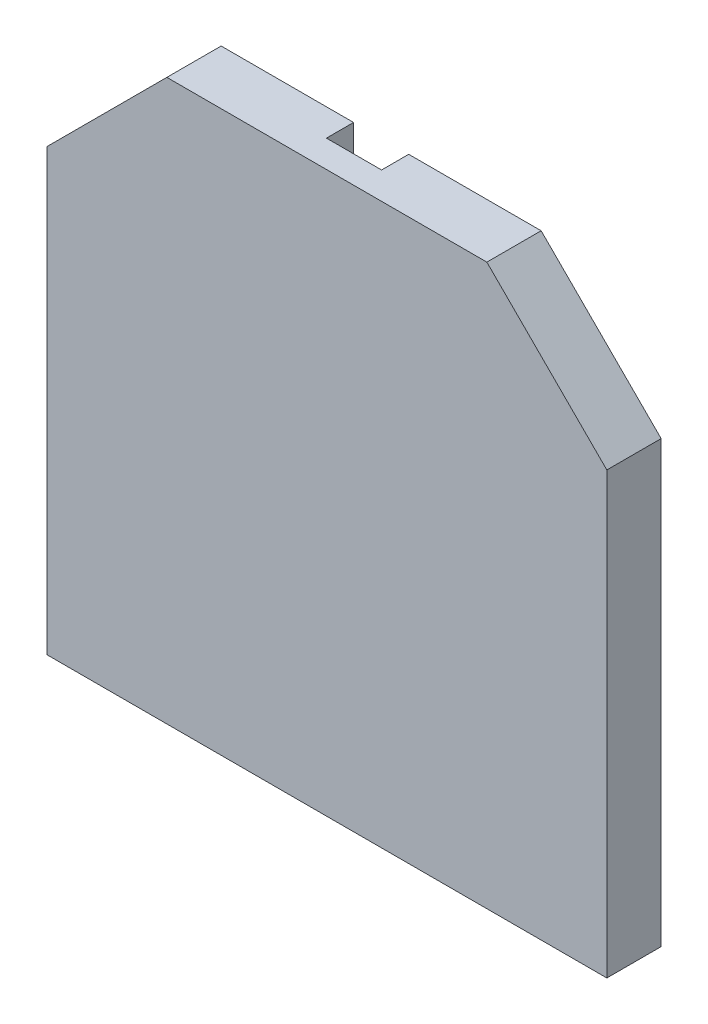
ISO-10303-21;
HEADER;
FILE_DESCRIPTION(('STEP AP214'),'2;1');
FILE_NAME('part.step','',(''),(''),'','','');
FILE_SCHEMA(('AUTOMOTIVE_DESIGN { 1 0 10303 214 1 1 1 1 }'));
ENDSEC;
DATA;
#1=APPLICATION_CONTEXT('core data for automotive mechanical design processes');
#2=APPLICATION_PROTOCOL_DEFINITION('international standard','automotive_design',2000,#1);
#3=PRODUCT_CONTEXT('',#1,'mechanical');
#4=PRODUCT('Part','Part','',(#3));
#5=PRODUCT_RELATED_PRODUCT_CATEGORY('part','',(#4));
#6=PRODUCT_DEFINITION_FORMATION('','',#4);
#7=PRODUCT_DEFINITION_CONTEXT('part definition',#1,'design');
#8=PRODUCT_DEFINITION('design','',#6,#7);
#9=PRODUCT_DEFINITION_SHAPE('','',#8);
#10=(LENGTH_UNIT() NAMED_UNIT(*) SI_UNIT(.MILLI.,.METRE.));
#11=(NAMED_UNIT(*) PLANE_ANGLE_UNIT() SI_UNIT($,.RADIAN.));
#12=(NAMED_UNIT(*) SI_UNIT($,.STERADIAN.) SOLID_ANGLE_UNIT());
#13=UNCERTAINTY_MEASURE_WITH_UNIT(LENGTH_MEASURE(1.E-05),#10,'distance_accuracy_value','');
#14=(GEOMETRIC_REPRESENTATION_CONTEXT(3) GLOBAL_UNCERTAINTY_ASSIGNED_CONTEXT((#13)) GLOBAL_UNIT_ASSIGNED_CONTEXT((#10,
#11,#12)) REPRESENTATION_CONTEXT('',''));
#15=CARTESIAN_POINT('',(0.,0.,0.));
#16=DIRECTION('',(0.,0.,1.));
#17=DIRECTION('',(1.,0.,0.));
#18=AXIS2_PLACEMENT_3D('',#15,#16,#17);
#19=CARTESIAN_POINT('',(-0.32500316,-3.71420136,0.31999936));
#20=DIRECTION('',(0.,0.,-1.));
#21=DIRECTION('',(-1.,0.,0.));
#22=AXIS2_PLACEMENT_3D('',#19,#20,#21);
#23=PLANE('',#22);
#24=DIRECTION('',(1.,0.,0.));
#25=VECTOR('',#24,1.);
#26=CARTESIAN_POINT('',(0.32499808,-3.71420136,0.31999936));
#27=LINE('',#26,#25);
#28=CARTESIAN_POINT('',(0.32499808,-3.71420136,0.31999936));
#29=VERTEX_POINT('',#28);
#30=CARTESIAN_POINT('',(-0.32500316,-3.71420136,0.31999936));
#31=VERTEX_POINT('',#30);
#32=EDGE_CURVE('E151',#29,#31,#27,.F.);
#33=ORIENTED_EDGE('',*,*,#32,.F.);
#34=DIRECTION('',(0.,1.,0.));
#35=VECTOR('',#34,1.);
#36=CARTESIAN_POINT('',(0.32499808,-6.31420124,0.31999936));
#37=LINE('',#36,#35);
#38=CARTESIAN_POINT('',(0.32499808,-6.11420164,0.31999936));
#39=VERTEX_POINT('',#38);
#40=EDGE_CURVE('E157',#39,#29,#37,.T.);
#41=ORIENTED_EDGE('',*,*,#40,.F.);
#42=DIRECTION('',(-1.,0.,0.));
#43=VECTOR('',#42,1.);
#44=CARTESIAN_POINT('',(-0.32500316,-6.11420164,0.31999936));
#45=LINE('',#44,#43);
#46=CARTESIAN_POINT('',(-0.32500316,-6.11420164,0.31999936));
#47=VERTEX_POINT('',#46);
#48=EDGE_CURVE('E19',#39,#47,#45,.T.);
#49=ORIENTED_EDGE('',*,*,#48,.T.);
#50=DIRECTION('',(0.,1.,0.));
#51=VECTOR('',#50,1.);
#52=CARTESIAN_POINT('',(-0.32500316,-3.71420136,0.31999936));
#53=LINE('',#52,#51);
#54=EDGE_CURVE('E145',#31,#47,#53,.F.);
#55=ORIENTED_EDGE('',*,*,#54,.F.);
#56=EDGE_LOOP('',(#33,#41,#49,#55));
#57=FACE_BOUND('',#56,.T.);
#58=ADVANCED_FACE('F16',(#57),#23,.T.);
#59=CARTESIAN_POINT('',(-0.32500316,0.68579492,0.31999936));
#60=DIRECTION('',(0.,0.,-1.));
#61=DIRECTION('',(-1.,0.,0.));
#62=AXIS2_PLACEMENT_3D('',#59,#60,#61);
#63=PLANE('',#62);
#64=DIRECTION('',(1.,0.,0.));
#65=VECTOR('',#64,1.);
#66=CARTESIAN_POINT('',(-0.32500316,-1.91420496,0.31999936));
#67=LINE('',#66,#65);
#68=CARTESIAN_POINT('',(-0.32500316,-1.91420496,0.31999936));
#69=VERTEX_POINT('',#68);
#70=CARTESIAN_POINT('',(0.32499808,-1.91420496,0.31999936));
#71=VERTEX_POINT('',#70);
#72=EDGE_CURVE('E115',#69,#71,#67,.T.);
#73=ORIENTED_EDGE('',*,*,#72,.F.);
#74=DIRECTION('',(0.,1.,0.));
#75=VECTOR('',#74,1.);
#76=CARTESIAN_POINT('',(-0.32500316,0.68579492,0.31999936));
#77=LINE('',#76,#75);
#78=CARTESIAN_POINT('',(-0.32500316,0.48579532,0.31999936));
#79=VERTEX_POINT('',#78);
#80=EDGE_CURVE('E129',#79,#69,#77,.F.);
#81=ORIENTED_EDGE('',*,*,#80,.F.);
#82=DIRECTION('',(-1.,0.,0.));
#83=VECTOR('',#82,1.);
#84=CARTESIAN_POINT('',(-0.32500316,0.48579532,0.31999936));
#85=LINE('',#84,#83);
#86=CARTESIAN_POINT('',(0.32499808,0.48579532,0.31999936));
#87=VERTEX_POINT('',#86);
#88=EDGE_CURVE('E120',#79,#87,#85,.F.);
#89=ORIENTED_EDGE('',*,*,#88,.T.);
#90=DIRECTION('',(0.,1.,0.));
#91=VECTOR('',#90,1.);
#92=CARTESIAN_POINT('',(0.32499808,-1.91420496,0.31999936));
#93=LINE('',#92,#91);
#94=EDGE_CURVE('E167',#71,#87,#93,.T.);
#95=ORIENTED_EDGE('',*,*,#94,.F.);
#96=EDGE_LOOP('',(#73,#81,#89,#95));
#97=FACE_BOUND('',#96,.T.);
#98=ADVANCED_FACE('F130',(#97),#63,.T.);
#99=CARTESIAN_POINT('',(-0.32500316,-1.91420496,-1.00000054));
#100=DIRECTION('',(0.,1.,0.));
#101=DIRECTION('',(0.,0.,1.));
#102=AXIS2_PLACEMENT_3D('',#99,#100,#101);
#103=PLANE('',#102);
#104=DIRECTION('',(0.,0.,-1.));
#105=VECTOR('',#104,1.);
#106=CARTESIAN_POINT('',(-0.32500316,-1.91420496,-1.00000054));
#107=LINE('',#106,#105);
#108=CARTESIAN_POINT('',(-0.32500316,-1.91420496,0.));
#109=VERTEX_POINT('',#108);
#110=EDGE_CURVE('E133',#69,#109,#107,.T.);
#111=ORIENTED_EDGE('',*,*,#110,.F.);
#112=ORIENTED_EDGE('',*,*,#72,.T.);
#113=DIRECTION('',(0.,0.,1.));
#114=VECTOR('',#113,1.);
#115=CARTESIAN_POINT('',(0.32499808,-1.91420496,-1.00000054));
#116=LINE('',#115,#114);
#117=CARTESIAN_POINT('',(0.32499808,-1.91420496,0.));
#118=VERTEX_POINT('',#117);
#119=EDGE_CURVE('E164',#118,#71,#116,.T.);
#120=ORIENTED_EDGE('',*,*,#119,.F.);
#121=DIRECTION('',(1.,0.,0.));
#122=VECTOR('',#121,1.);
#123=CARTESIAN_POINT('',(-1.88578998,-1.91420496,0.));
#124=LINE('',#123,#122);
#125=EDGE_CURVE('E169',#118,#109,#124,.F.);
#126=ORIENTED_EDGE('',*,*,#125,.T.);
#127=EDGE_LOOP('',(#111,#112,#120,#126));
#128=FACE_BOUND('',#127,.T.);
#129=ADVANCED_FACE('F245',(#128),#103,.T.);
#130=CARTESIAN_POINT('',(-0.32500316,0.68579492,-1.00000054));
#131=DIRECTION('',(1.,0.,0.));
#132=DIRECTION('',(0.,0.,-1.));
#133=AXIS2_PLACEMENT_3D('',#130,#131,#132);
#134=PLANE('',#133);
#135=ORIENTED_EDGE('',*,*,#110,.T.);
#136=DIRECTION('',(0.,1.,0.));
#137=VECTOR('',#136,1.);
#138=CARTESIAN_POINT('',(-0.32500316,0.48579532,0.));
#139=LINE('',#138,#137);
#140=CARTESIAN_POINT('',(-0.32500316,0.48579532,0.));
#141=VERTEX_POINT('',#140);
#142=EDGE_CURVE('E137',#109,#141,#139,.T.);
#143=ORIENTED_EDGE('',*,*,#142,.T.);
#144=DIRECTION('',(0.,0.,-1.));
#145=VECTOR('',#144,1.);
#146=CARTESIAN_POINT('',(-0.32500316,0.48579532,-1.00000054));
#147=LINE('',#146,#145);
#148=EDGE_CURVE('E123',#141,#79,#147,.F.);
#149=ORIENTED_EDGE('',*,*,#148,.T.);
#150=ORIENTED_EDGE('',*,*,#80,.T.);
#151=EDGE_LOOP('',(#135,#143,#149,#150));
#152=FACE_BOUND('',#151,.T.);
#153=ADVANCED_FACE('F135',(#152),#134,.T.);
#154=CARTESIAN_POINT('',(-0.32500316,-3.71420136,-1.00000054));
#155=DIRECTION('',(1.,0.,0.));
#156=DIRECTION('',(0.,0.,-1.));
#157=AXIS2_PLACEMENT_3D('',#154,#155,#156);
#158=PLANE('',#157);
#159=DIRECTION('',(0.,0.,-1.));
#160=VECTOR('',#159,1.);
#161=CARTESIAN_POINT('',(-0.32500316,-3.71420136,-1.00000054));
#162=LINE('',#161,#160);
#163=CARTESIAN_POINT('',(-0.32500316,-3.71420136,0.));
#164=VERTEX_POINT('',#163);
#165=EDGE_CURVE('E148',#31,#164,#162,.T.);
#166=ORIENTED_EDGE('',*,*,#165,.F.);
#167=ORIENTED_EDGE('',*,*,#54,.T.);
#168=DIRECTION('',(0.,0.,-1.));
#169=VECTOR('',#168,1.);
#170=CARTESIAN_POINT('',(-0.32500316,-6.11420164,-1.00000054));
#171=LINE('',#170,#169);
#172=CARTESIAN_POINT('',(-0.32500316,-6.11420164,0.));
#173=VERTEX_POINT('',#172);
#174=EDGE_CURVE('E143',#47,#173,#171,.T.);
#175=ORIENTED_EDGE('',*,*,#174,.T.);
#176=DIRECTION('',(0.,1.,0.));
#177=VECTOR('',#176,1.);
#178=CARTESIAN_POINT('',(-0.32500316,0.48579532,0.));
#179=LINE('',#178,#177);
#180=EDGE_CURVE('E174',#173,#164,#179,.T.);
#181=ORIENTED_EDGE('',*,*,#180,.T.);
#182=EDGE_LOOP('',(#166,#167,#175,#181));
#183=FACE_BOUND('',#182,.T.);
#184=ADVANCED_FACE('F268',(#183),#158,.T.);
#185=CARTESIAN_POINT('',(0.32499808,-3.71420136,-1.00000054));
#186=DIRECTION('',(0.,-1.,0.));
#187=DIRECTION('',(0.,0.,-1.));
#188=AXIS2_PLACEMENT_3D('',#185,#186,#187);
#189=PLANE('',#188);
#190=DIRECTION('',(0.,0.,1.));
#191=VECTOR('',#190,1.);
#192=CARTESIAN_POINT('',(0.32499808,-3.71420136,-1.00000054));
#193=LINE('',#192,#191);
#194=CARTESIAN_POINT('',(0.32499808,-3.71420136,0.));
#195=VERTEX_POINT('',#194);
#196=EDGE_CURVE('E160',#29,#195,#193,.F.);
#197=ORIENTED_EDGE('',*,*,#196,.F.);
#198=ORIENTED_EDGE('',*,*,#32,.T.);
#199=ORIENTED_EDGE('',*,*,#165,.T.);
#200=DIRECTION('',(1.,0.,0.));
#201=VECTOR('',#200,1.);
#202=CARTESIAN_POINT('',(-1.88578998,-3.71420136,0.));
#203=LINE('',#202,#201);
#204=EDGE_CURVE('E176',#164,#195,#203,.T.);
#205=ORIENTED_EDGE('',*,*,#204,.T.);
#206=EDGE_LOOP('',(#197,#198,#199,#205));
#207=FACE_BOUND('',#206,.T.);
#208=ADVANCED_FACE('F265',(#207),#189,.T.);
#209=CARTESIAN_POINT('',(0.32499808,-6.31420124,-1.00000054));
#210=DIRECTION('',(-1.,0.,0.));
#211=DIRECTION('',(0.,0.,1.));
#212=AXIS2_PLACEMENT_3D('',#209,#210,#211);
#213=PLANE('',#212);
#214=ORIENTED_EDGE('',*,*,#196,.T.);
#215=DIRECTION('',(0.,1.,0.));
#216=VECTOR('',#215,1.);
#217=CARTESIAN_POINT('',(0.32499808,0.48579532,0.));
#218=LINE('',#217,#216);
#219=CARTESIAN_POINT('',(0.32499808,-6.11420164,0.));
#220=VERTEX_POINT('',#219);
#221=EDGE_CURVE('E178',#195,#220,#218,.F.);
#222=ORIENTED_EDGE('',*,*,#221,.T.);
#223=DIRECTION('',(0.,0.,1.));
#224=VECTOR('',#223,1.);
#225=CARTESIAN_POINT('',(0.32499808,-6.11420164,-1.00000054));
#226=LINE('',#225,#224);
#227=EDGE_CURVE('E154',#220,#39,#226,.T.);
#228=ORIENTED_EDGE('',*,*,#227,.T.);
#229=ORIENTED_EDGE('',*,*,#40,.T.);
#230=EDGE_LOOP('',(#214,#222,#228,#229));
#231=FACE_BOUND('',#230,.T.);
#232=ADVANCED_FACE('F261',(#231),#213,.T.);
#233=CARTESIAN_POINT('',(0.32499808,-1.91420496,-1.00000054));
#234=DIRECTION('',(-1.,0.,0.));
#235=DIRECTION('',(0.,0.,1.));
#236=AXIS2_PLACEMENT_3D('',#233,#234,#235);
#237=PLANE('',#236);
#238=ORIENTED_EDGE('',*,*,#119,.T.);
#239=ORIENTED_EDGE('',*,*,#94,.T.);
#240=DIRECTION('',(0.,0.,1.));
#241=VECTOR('',#240,1.);
#242=CARTESIAN_POINT('',(0.32499808,0.48579532,-1.00000054));
#243=LINE('',#242,#241);
#244=CARTESIAN_POINT('',(0.32499808,0.48579532,0.));
#245=VERTEX_POINT('',#244);
#246=EDGE_CURVE('E126',#87,#245,#243,.F.);
#247=ORIENTED_EDGE('',*,*,#246,.T.);
#248=DIRECTION('',(0.,1.,0.));
#249=VECTOR('',#248,1.);
#250=CARTESIAN_POINT('',(0.32499808,0.48579532,0.));
#251=LINE('',#250,#249);
#252=EDGE_CURVE('E183',#245,#118,#251,.F.);
#253=ORIENTED_EDGE('',*,*,#252,.T.);
#254=EDGE_LOOP('',(#238,#239,#247,#253));
#255=FACE_BOUND('',#254,.T.);
#256=ADVANCED_FACE('F243',(#255),#237,.T.);
#257=CARTESIAN_POINT('',(-1.88578998,0.48579532,0.));
#258=DIRECTION('',(0.,0.,1.));
#259=DIRECTION('',(1.,0.,0.));
#260=AXIS2_PLACEMENT_3D('',#257,#258,#259);
#261=PLANE('',#260);
#262=DIRECTION('',(1.,0.,0.));
#263=VECTOR('',#262,1.);
#264=CARTESIAN_POINT('',(-1.88578998,0.48579532,0.));
#265=LINE('',#264,#263);
#266=CARTESIAN_POINT('',(1.8857849,0.48579532,0.));
#267=VERTEX_POINT('',#266);
#268=EDGE_CURVE('E181',#267,#245,#265,.F.);
#269=ORIENTED_EDGE('',*,*,#268,.F.);
#270=DIRECTION('',(-0.707106781186548,0.707106781186548,0.));
#271=VECTOR('',#270,1.);
#272=CARTESIAN_POINT('',(1.8857849,0.48579532,0.));
#273=LINE('',#272,#271);
#274=CARTESIAN_POINT('',(3.29999848,-0.92841826,0.));
#275=VERTEX_POINT('',#274);
#276=EDGE_CURVE('E210',#275,#267,#273,.T.);
#277=ORIENTED_EDGE('',*,*,#276,.F.);
#278=DIRECTION('',(0.,1.,0.));
#279=VECTOR('',#278,1.);
#280=CARTESIAN_POINT('',(3.29999848,-0.92841826,0.));
#281=LINE('',#280,#279);
#282=CARTESIAN_POINT('',(3.29999848,-6.11420164,0.));
#283=VERTEX_POINT('',#282);
#284=EDGE_CURVE('E205',#283,#275,#281,.T.);
#285=ORIENTED_EDGE('',*,*,#284,.F.);
#286=DIRECTION('',(1.,0.,0.));
#287=VECTOR('',#286,1.);
#288=CARTESIAN_POINT('',(3.29999848,-6.11420164,0.));
#289=LINE('',#288,#287);
#290=EDGE_CURVE('E197',#220,#283,#289,.T.);
#291=ORIENTED_EDGE('',*,*,#290,.F.);
#292=ORIENTED_EDGE('',*,*,#221,.F.);
#293=ORIENTED_EDGE('',*,*,#204,.F.);
#294=ORIENTED_EDGE('',*,*,#180,.F.);
#295=DIRECTION('',(1.,0.,0.));
#296=VECTOR('',#295,1.);
#297=CARTESIAN_POINT('',(3.29999848,-6.11420164,0.));
#298=LINE('',#297,#296);
#299=CARTESIAN_POINT('',(-3.30000356,-6.11420164,0.));
#300=VERTEX_POINT('',#299);
#301=EDGE_CURVE('E194',#300,#173,#298,.T.);
#302=ORIENTED_EDGE('',*,*,#301,.F.);
#303=DIRECTION('',(0.,1.,0.));
#304=VECTOR('',#303,1.);
#305=CARTESIAN_POINT('',(-3.30000356,-6.11420164,0.));
#306=LINE('',#305,#304);
#307=CARTESIAN_POINT('',(-3.30000356,-0.92841826,0.));
#308=VERTEX_POINT('',#307);
#309=EDGE_CURVE('E191',#308,#300,#306,.F.);
#310=ORIENTED_EDGE('',*,*,#309,.F.);
#311=DIRECTION('',(-0.707106781186548,-0.707106781186548,0.));
#312=VECTOR('',#311,1.);
#313=CARTESIAN_POINT('',(-3.30000356,-0.92841826,0.));
#314=LINE('',#313,#312);
#315=CARTESIAN_POINT('',(-1.88578998,0.48579532,0.));
#316=VERTEX_POINT('',#315);
#317=EDGE_CURVE('E186',#316,#308,#314,.T.);
#318=ORIENTED_EDGE('',*,*,#317,.F.);
#319=DIRECTION('',(1.,0.,0.));
#320=VECTOR('',#319,1.);
#321=CARTESIAN_POINT('',(-1.88578998,0.48579532,0.));
#322=LINE('',#321,#320);
#323=EDGE_CURVE('E172',#141,#316,#322,.F.);
#324=ORIENTED_EDGE('',*,*,#323,.F.);
#325=ORIENTED_EDGE('',*,*,#142,.F.);
#326=ORIENTED_EDGE('',*,*,#125,.F.);
#327=ORIENTED_EDGE('',*,*,#252,.F.);
#328=EDGE_LOOP('',(#269,#277,#285,#291,#292,#293,#294,#302,#310,#318,#324,#325,#326,#327));
#329=FACE_BOUND('',#328,.T.);
#330=ADVANCED_FACE('F239',(#329),#261,.F.);
#331=CARTESIAN_POINT('',(-3.30000356,-0.92841826,0.));
#332=DIRECTION('',(-0.707106781186548,0.707106781186548,0.));
#333=DIRECTION('',(-0.707106781186548,-0.707106781186548,0.));
#334=AXIS2_PLACEMENT_3D('',#331,#332,#333);
#335=PLANE('',#334);
#336=DIRECTION('',(0.,0.,1.));
#337=VECTOR('',#336,1.);
#338=CARTESIAN_POINT('',(-1.88578998,0.48579532,0.));
#339=LINE('',#338,#337);
#340=CARTESIAN_POINT('',(-1.88578998,0.48579532,0.64000126));
#341=VERTEX_POINT('',#340);
#342=EDGE_CURVE('E212',#316,#341,#339,.T.);
#343=ORIENTED_EDGE('',*,*,#342,.F.);
#344=ORIENTED_EDGE('',*,*,#317,.T.);
#345=DIRECTION('',(0.,0.,1.));
#346=VECTOR('',#345,1.);
#347=CARTESIAN_POINT('',(-3.30000356,-0.92841826,0.));
#348=LINE('',#347,#346);
#349=CARTESIAN_POINT('',(-3.30000356,-0.92841826,0.64000126));
#350=VERTEX_POINT('',#349);
#351=EDGE_CURVE('E188',#350,#308,#348,.F.);
#352=ORIENTED_EDGE('',*,*,#351,.F.);
#353=DIRECTION('',(-0.707106781186547,-0.707106781186547,0.));
#354=VECTOR('',#353,1.);
#355=CARTESIAN_POINT('',(-1.88578998,0.48579532,0.64000126));
#356=LINE('',#355,#354);
#357=EDGE_CURVE('E216',#341,#350,#356,.T.);
#358=ORIENTED_EDGE('',*,*,#357,.F.);
#359=EDGE_LOOP('',(#343,#344,#352,#358));
#360=FACE_BOUND('',#359,.T.);
#361=ADVANCED_FACE('F250',(#360),#335,.T.);
#362=CARTESIAN_POINT('',(-3.30000356,-6.11420164,0.));
#363=DIRECTION('',(-1.,0.,0.));
#364=DIRECTION('',(0.,0.,1.));
#365=AXIS2_PLACEMENT_3D('',#362,#363,#364);
#366=PLANE('',#365);
#367=ORIENTED_EDGE('',*,*,#351,.T.);
#368=ORIENTED_EDGE('',*,*,#309,.T.);
#369=DIRECTION('',(0.,0.,-1.));
#370=VECTOR('',#369,1.);
#371=CARTESIAN_POINT('',(-3.30000356,-6.11420164,0.));
#372=LINE('',#371,#370);
#373=CARTESIAN_POINT('',(-3.30000356,-6.11420164,0.64000126));
#374=VERTEX_POINT('',#373);
#375=EDGE_CURVE('E199',#374,#300,#372,.T.);
#376=ORIENTED_EDGE('',*,*,#375,.F.);
#377=DIRECTION('',(0.,1.,0.));
#378=VECTOR('',#377,1.);
#379=CARTESIAN_POINT('',(-3.30000356,0.48579532,0.64000126));
#380=LINE('',#379,#378);
#381=EDGE_CURVE('E219',#350,#374,#380,.F.);
#382=ORIENTED_EDGE('',*,*,#381,.F.);
#383=EDGE_LOOP('',(#367,#368,#376,#382));
#384=FACE_BOUND('',#383,.T.);
#385=ADVANCED_FACE('F254',(#384),#366,.T.);
#386=CARTESIAN_POINT('',(3.29999848,-6.11420164,0.));
#387=DIRECTION('',(0.,-1.,0.));
#388=DIRECTION('',(0.,0.,-1.));
#389=AXIS2_PLACEMENT_3D('',#386,#387,#388);
#390=PLANE('',#389);
#391=DIRECTION('',(1.,0.,0.));
#392=VECTOR('',#391,1.);
#393=CARTESIAN_POINT('',(-1.88578998,-6.11420164,0.64000126));
#394=LINE('',#393,#392);
#395=CARTESIAN_POINT('',(3.29999848,-6.11420164,0.64000126));
#396=VERTEX_POINT('',#395);
#397=EDGE_CURVE('E222',#374,#396,#394,.T.);
#398=ORIENTED_EDGE('',*,*,#397,.F.);
#399=ORIENTED_EDGE('',*,*,#375,.T.);
#400=ORIENTED_EDGE('',*,*,#301,.T.);
#401=ORIENTED_EDGE('',*,*,#174,.F.);
#402=ORIENTED_EDGE('',*,*,#48,.F.);
#403=ORIENTED_EDGE('',*,*,#227,.F.);
#404=ORIENTED_EDGE('',*,*,#290,.T.);
#405=DIRECTION('',(0.,0.,-1.));
#406=VECTOR('',#405,1.);
#407=CARTESIAN_POINT('',(3.29999848,-6.11420164,0.));
#408=LINE('',#407,#406);
#409=EDGE_CURVE('E202',#396,#283,#408,.T.);
#410=ORIENTED_EDGE('',*,*,#409,.F.);
#411=EDGE_LOOP('',(#398,#399,#400,#401,#402,#403,#404,#410));
#412=FACE_BOUND('',#411,.T.);
#413=ADVANCED_FACE('F256',(#412),#390,.T.);
#414=CARTESIAN_POINT('',(3.29999848,-0.92841826,0.));
#415=DIRECTION('',(1.,0.,0.));
#416=DIRECTION('',(0.,0.,-1.));
#417=AXIS2_PLACEMENT_3D('',#414,#415,#416);
#418=PLANE('',#417);
#419=ORIENTED_EDGE('',*,*,#409,.T.);
#420=ORIENTED_EDGE('',*,*,#284,.T.);
#421=DIRECTION('',(0.,0.,1.));
#422=VECTOR('',#421,1.);
#423=CARTESIAN_POINT('',(3.29999848,-0.92841826,0.));
#424=LINE('',#423,#422);
#425=CARTESIAN_POINT('',(3.29999848,-0.92841826,0.64000126));
#426=VERTEX_POINT('',#425);
#427=EDGE_CURVE('E207',#426,#275,#424,.F.);
#428=ORIENTED_EDGE('',*,*,#427,.F.);
#429=DIRECTION('',(0.,1.,0.));
#430=VECTOR('',#429,1.);
#431=CARTESIAN_POINT('',(3.29999848,0.48579532,0.64000126));
#432=LINE('',#431,#430);
#433=EDGE_CURVE('E225',#396,#426,#432,.T.);
#434=ORIENTED_EDGE('',*,*,#433,.F.);
#435=EDGE_LOOP('',(#419,#420,#428,#434));
#436=FACE_BOUND('',#435,.T.);
#437=ADVANCED_FACE('F235',(#436),#418,.T.);
#438=CARTESIAN_POINT('',(1.8857849,0.48579532,0.));
#439=DIRECTION('',(0.707106781186548,0.707106781186548,0.));
#440=DIRECTION('',(-0.707106781186548,0.707106781186548,0.));
#441=AXIS2_PLACEMENT_3D('',#438,#439,#440);
#442=PLANE('',#441);
#443=ORIENTED_EDGE('',*,*,#427,.T.);
#444=ORIENTED_EDGE('',*,*,#276,.T.);
#445=DIRECTION('',(0.,0.,1.));
#446=VECTOR('',#445,1.);
#447=CARTESIAN_POINT('',(1.8857849,0.48579532,0.));
#448=LINE('',#447,#446);
#449=CARTESIAN_POINT('',(1.8857849,0.48579532,0.64000126));
#450=VERTEX_POINT('',#449);
#451=EDGE_CURVE('E34',#450,#267,#448,.F.);
#452=ORIENTED_EDGE('',*,*,#451,.F.);
#453=DIRECTION('',(-0.707106781186547,0.707106781186547,0.));
#454=VECTOR('',#453,1.);
#455=CARTESIAN_POINT('',(3.29999848,-0.92841826,0.64000126));
#456=LINE('',#455,#454);
#457=EDGE_CURVE('E25',#426,#450,#456,.T.);
#458=ORIENTED_EDGE('',*,*,#457,.F.);
#459=EDGE_LOOP('',(#443,#444,#452,#458));
#460=FACE_BOUND('',#459,.T.);
#461=ADVANCED_FACE('F232',(#460),#442,.T.);
#462=CARTESIAN_POINT('',(-1.88578998,0.48579532,0.));
#463=DIRECTION('',(0.,1.,0.));
#464=DIRECTION('',(0.,0.,1.));
#465=AXIS2_PLACEMENT_3D('',#462,#463,#464);
#466=PLANE('',#465);
#467=ORIENTED_EDGE('',*,*,#268,.T.);
#468=ORIENTED_EDGE('',*,*,#246,.F.);
#469=ORIENTED_EDGE('',*,*,#88,.F.);
#470=ORIENTED_EDGE('',*,*,#148,.F.);
#471=ORIENTED_EDGE('',*,*,#323,.T.);
#472=ORIENTED_EDGE('',*,*,#342,.T.);
#473=DIRECTION('',(1.,0.,0.));
#474=VECTOR('',#473,1.);
#475=CARTESIAN_POINT('',(-1.88578998,0.48579532,0.64000126));
#476=LINE('',#475,#474);
#477=EDGE_CURVE('E11',#450,#341,#476,.F.);
#478=ORIENTED_EDGE('',*,*,#477,.F.);
#479=ORIENTED_EDGE('',*,*,#451,.T.);
#480=EDGE_LOOP('',(#467,#468,#469,#470,#471,#472,#478,#479));
#481=FACE_BOUND('',#480,.T.);
#482=ADVANCED_FACE('F121',(#481),#466,.T.);
#483=CARTESIAN_POINT('',(-1.88578998,0.48579532,0.64000126));
#484=DIRECTION('',(0.,0.,1.));
#485=DIRECTION('',(1.,0.,0.));
#486=AXIS2_PLACEMENT_3D('',#483,#484,#485);
#487=PLANE('',#486);
#488=ORIENTED_EDGE('',*,*,#457,.T.);
#489=ORIENTED_EDGE('',*,*,#477,.T.);
#490=ORIENTED_EDGE('',*,*,#357,.T.);
#491=ORIENTED_EDGE('',*,*,#381,.T.);
#492=ORIENTED_EDGE('',*,*,#397,.T.);
#493=ORIENTED_EDGE('',*,*,#433,.T.);
#494=EDGE_LOOP('',(#488,#489,#490,#491,#492,#493));
#495=FACE_BOUND('',#494,.T.);
#496=ADVANCED_FACE('F230',(#495),#487,.T.);
#497=CLOSED_SHELL('',(#58,#98,#129,#153,#184,#208,#232,#256,#330,#361,#385,#413,#437,#461,#482,#496));
#498=MANIFOLD_SOLID_BREP('B1',#497);
#499=ADVANCED_BREP_SHAPE_REPRESENTATION('',(#18,#498),#14);
#500=SHAPE_DEFINITION_REPRESENTATION(#9,#499);
ENDSEC;
END-ISO-10303-21;
